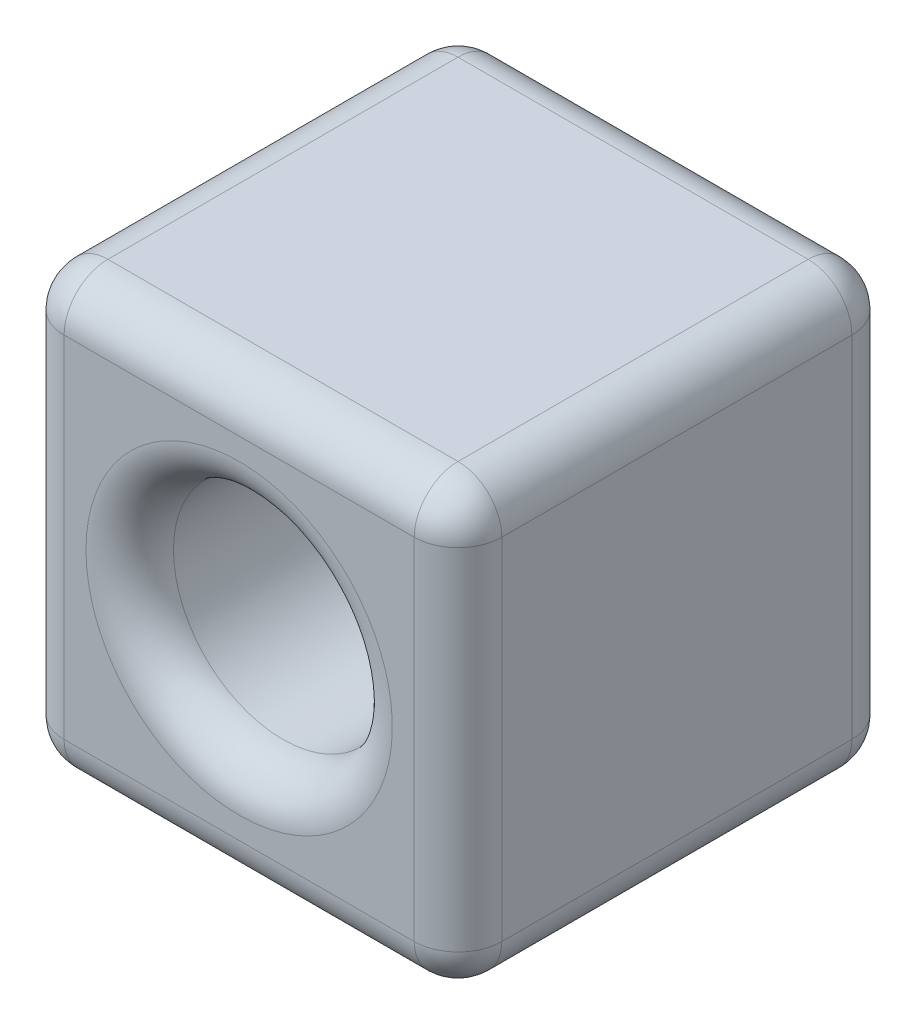
ISO-10303-21;
HEADER;
FILE_DESCRIPTION(('STEP AP214'),'2;1');
FILE_NAME('part.step','',(''),(''),'','','');
FILE_SCHEMA(('AUTOMOTIVE_DESIGN { 1 0 10303 214 1 1 1 1 }'));
ENDSEC;
DATA;
#1=APPLICATION_CONTEXT('core data for automotive mechanical design processes');
#2=APPLICATION_PROTOCOL_DEFINITION('international standard','automotive_design',2000,#1);
#3=PRODUCT_CONTEXT('',#1,'mechanical');
#4=PRODUCT('Part','Part','',(#3));
#5=PRODUCT_RELATED_PRODUCT_CATEGORY('part','',(#4));
#6=PRODUCT_DEFINITION_FORMATION('','',#4);
#7=PRODUCT_DEFINITION_CONTEXT('part definition',#1,'design');
#8=PRODUCT_DEFINITION('design','',#6,#7);
#9=PRODUCT_DEFINITION_SHAPE('','',#8);
#10=(LENGTH_UNIT() NAMED_UNIT(*) SI_UNIT(.MILLI.,.METRE.));
#11=(NAMED_UNIT(*) PLANE_ANGLE_UNIT() SI_UNIT($,.RADIAN.));
#12=(NAMED_UNIT(*) SI_UNIT($,.STERADIAN.) SOLID_ANGLE_UNIT());
#13=UNCERTAINTY_MEASURE_WITH_UNIT(LENGTH_MEASURE(1.E-05),#10,'distance_accuracy_value','');
#14=(GEOMETRIC_REPRESENTATION_CONTEXT(3) GLOBAL_UNCERTAINTY_ASSIGNED_CONTEXT((#13)) GLOBAL_UNIT_ASSIGNED_CONTEXT((#10,
#11,#12)) REPRESENTATION_CONTEXT('',''));
#15=CARTESIAN_POINT('',(0.,0.,0.));
#16=DIRECTION('',(0.,0.,1.));
#17=DIRECTION('',(1.,0.,0.));
#18=AXIS2_PLACEMENT_3D('',#15,#16,#17);
#19=CARTESIAN_POINT('',(0.,100.,0.));
#20=DIRECTION('',(1.,0.,0.));
#21=DIRECTION('',(0.,0.,-1.));
#22=AXIS2_PLACEMENT_3D('',#19,#20,#21);
#23=PLANE('',#22);
#24=DIRECTION('',(0.,-1.,0.));
#25=VECTOR('',#24,1.);
#26=CARTESIAN_POINT('',(0.,100.,-90.));
#27=LINE('',#26,#25);
#28=CARTESIAN_POINT('',(0.,90.,-90.));
#29=VERTEX_POINT('',#28);
#30=CARTESIAN_POINT('',(0.,9.99999999999999,-90.));
#31=VERTEX_POINT('',#30);
#32=EDGE_CURVE('E228',#29,#31,#27,.T.);
#33=ORIENTED_EDGE('',*,*,#32,.T.);
#34=DIRECTION('',(0.,0.,1.));
#35=VECTOR('',#34,1.);
#36=CARTESIAN_POINT('',(0.,9.99999999999999,-10.));
#37=LINE('',#36,#35);
#38=CARTESIAN_POINT('',(0.,9.99999999999999,-10.));
#39=VERTEX_POINT('',#38);
#40=EDGE_CURVE('E176',#31,#39,#37,.T.);
#41=ORIENTED_EDGE('',*,*,#40,.T.);
#42=DIRECTION('',(0.,-1.,0.));
#43=VECTOR('',#42,1.);
#44=CARTESIAN_POINT('',(0.,100.,-10.));
#45=LINE('',#44,#43);
#46=CARTESIAN_POINT('',(0.,90.,-10.));
#47=VERTEX_POINT('',#46);
#48=EDGE_CURVE('E134',#39,#47,#45,.F.);
#49=ORIENTED_EDGE('',*,*,#48,.T.);
#50=DIRECTION('',(0.,0.,1.));
#51=VECTOR('',#50,1.);
#52=CARTESIAN_POINT('',(0.,90.,0.));
#53=LINE('',#52,#51);
#54=EDGE_CURVE('E174',#47,#29,#53,.F.);
#55=ORIENTED_EDGE('',*,*,#54,.T.);
#56=EDGE_LOOP('',(#33,#41,#49,#55));
#57=FACE_BOUND('',#56,.T.);
#58=ADVANCED_FACE('F35',(#57),#23,.F.);
#59=CARTESIAN_POINT('',(0.,100.,0.));
#60=DIRECTION('',(0.,0.,-1.));
#61=DIRECTION('',(-1.,0.,0.));
#62=AXIS2_PLACEMENT_3D('',#59,#60,#61);
#63=PLANE('',#62);
#64=DIRECTION('',(1.,0.,0.));
#65=VECTOR('',#64,1.);
#66=CARTESIAN_POINT('',(0.,90.,0.));
#67=LINE('',#66,#65);
#68=CARTESIAN_POINT('',(90.,90.,0.));
#69=VERTEX_POINT('',#68);
#70=CARTESIAN_POINT('',(10.,90.,0.));
#71=VERTEX_POINT('',#70);
#72=EDGE_CURVE('E161',#69,#71,#67,.F.);
#73=ORIENTED_EDGE('',*,*,#72,.T.);
#74=DIRECTION('',(0.,-1.,0.));
#75=VECTOR('',#74,1.);
#76=CARTESIAN_POINT('',(10.,100.,0.));
#77=LINE('',#76,#75);
#78=CARTESIAN_POINT('',(10.,9.99999999999999,0.));
#79=VERTEX_POINT('',#78);
#80=EDGE_CURVE('E131',#71,#79,#77,.T.);
#81=ORIENTED_EDGE('',*,*,#80,.T.);
#82=DIRECTION('',(1.,0.,0.));
#83=VECTOR('',#82,1.);
#84=CARTESIAN_POINT('',(100.,9.99999999999999,0.));
#85=LINE('',#84,#83);
#86=CARTESIAN_POINT('',(90.,9.99999999999999,0.));
#87=VERTEX_POINT('',#86);
#88=EDGE_CURVE('E145',#79,#87,#85,.T.);
#89=ORIENTED_EDGE('',*,*,#88,.T.);
#90=DIRECTION('',(0.,-1.,0.));
#91=VECTOR('',#90,1.);
#92=CARTESIAN_POINT('',(90.,100.,0.));
#93=LINE('',#92,#91);
#94=EDGE_CURVE('E154',#87,#69,#93,.F.);
#95=ORIENTED_EDGE('',*,*,#94,.T.);
#96=EDGE_LOOP('',(#73,#81,#89,#95));
#97=FACE_BOUND('',#96,.T.);
#98=CARTESIAN_POINT('',(50.,50.,0.));
#99=DIRECTION('',(0.,0.,-1.));
#100=DIRECTION('',(-1.,0.,0.));
#101=AXIS2_PLACEMENT_3D('',#98,#99,#100);
#102=CIRCLE('',#101,35.);
#103=CARTESIAN_POINT('',(15.,50.,0.));
#104=VERTEX_POINT('',#103);
#105=EDGE_CURVE('E155',#104,#104,#102,.T.);
#106=ORIENTED_EDGE('',*,*,#105,.T.);
#107=EDGE_LOOP('',(#106));
#108=FACE_BOUND('',#107,.T.);
#109=ADVANCED_FACE('F158',(#97,#108),#63,.F.);
#110=CARTESIAN_POINT('',(100.,100.,0.));
#111=DIRECTION('',(-1.,0.,0.));
#112=DIRECTION('',(0.,0.,1.));
#113=AXIS2_PLACEMENT_3D('',#110,#111,#112);
#114=PLANE('',#113);
#115=DIRECTION('',(0.,-1.,0.));
#116=VECTOR('',#115,1.);
#117=CARTESIAN_POINT('',(100.,100.,-90.));
#118=LINE('',#117,#116);
#119=CARTESIAN_POINT('',(100.,9.99999999999999,-90.));
#120=VERTEX_POINT('',#119);
#121=CARTESIAN_POINT('',(100.,90.,-90.));
#122=VERTEX_POINT('',#121);
#123=EDGE_CURVE('E223',#120,#122,#118,.F.);
#124=ORIENTED_EDGE('',*,*,#123,.T.);
#125=DIRECTION('',(0.,0.,-1.));
#126=VECTOR('',#125,1.);
#127=CARTESIAN_POINT('',(100.,90.,0.));
#128=LINE('',#127,#126);
#129=CARTESIAN_POINT('',(100.,90.,-10.));
#130=VERTEX_POINT('',#129);
#131=EDGE_CURVE('E255',#122,#130,#128,.F.);
#132=ORIENTED_EDGE('',*,*,#131,.T.);
#133=DIRECTION('',(0.,-1.,0.));
#134=VECTOR('',#133,1.);
#135=CARTESIAN_POINT('',(100.,100.,-10.));
#136=LINE('',#135,#134);
#137=CARTESIAN_POINT('',(100.,9.99999999999999,-10.));
#138=VERTEX_POINT('',#137);
#139=EDGE_CURVE('E197',#130,#138,#136,.T.);
#140=ORIENTED_EDGE('',*,*,#139,.T.);
#141=DIRECTION('',(0.,0.,-1.));
#142=VECTOR('',#141,1.);
#143=CARTESIAN_POINT('',(100.,9.99999999999999,-90.));
#144=LINE('',#143,#142);
#145=EDGE_CURVE('E253',#138,#120,#144,.T.);
#146=ORIENTED_EDGE('',*,*,#145,.T.);
#147=EDGE_LOOP('',(#124,#132,#140,#146));
#148=FACE_BOUND('',#147,.T.);
#149=ADVANCED_FACE('F343',(#148),#114,.F.);
#150=CARTESIAN_POINT('',(0.,100.,-100.));
#151=DIRECTION('',(0.,0.,1.));
#152=DIRECTION('',(1.,0.,0.));
#153=AXIS2_PLACEMENT_3D('',#150,#151,#152);
#154=PLANE('',#153);
#155=DIRECTION('',(-1.,0.,0.));
#156=VECTOR('',#155,1.);
#157=CARTESIAN_POINT('',(0.,90.,-100.));
#158=LINE('',#157,#156);
#159=CARTESIAN_POINT('',(10.,90.,-100.));
#160=VERTEX_POINT('',#159);
#161=CARTESIAN_POINT('',(90.,90.,-100.));
#162=VERTEX_POINT('',#161);
#163=EDGE_CURVE('E217',#160,#162,#158,.F.);
#164=ORIENTED_EDGE('',*,*,#163,.T.);
#165=DIRECTION('',(0.,-1.,0.));
#166=VECTOR('',#165,1.);
#167=CARTESIAN_POINT('',(90.,100.,-100.));
#168=LINE('',#167,#166);
#169=CARTESIAN_POINT('',(90.,9.99999999999999,-100.));
#170=VERTEX_POINT('',#169);
#171=EDGE_CURVE('E220',#162,#170,#168,.T.);
#172=ORIENTED_EDGE('',*,*,#171,.T.);
#173=DIRECTION('',(-1.,0.,0.));
#174=VECTOR('',#173,1.);
#175=CARTESIAN_POINT('',(0.,9.99999999999999,-100.));
#176=LINE('',#175,#174);
#177=CARTESIAN_POINT('',(10.,9.99999999999999,-100.));
#178=VERTEX_POINT('',#177);
#179=EDGE_CURVE('E211',#170,#178,#176,.T.);
#180=ORIENTED_EDGE('',*,*,#179,.T.);
#181=DIRECTION('',(0.,-1.,0.));
#182=VECTOR('',#181,1.);
#183=CARTESIAN_POINT('',(10.,100.,-100.));
#184=LINE('',#183,#182);
#185=EDGE_CURVE('E214',#178,#160,#184,.F.);
#186=ORIENTED_EDGE('',*,*,#185,.T.);
#187=EDGE_LOOP('',(#164,#172,#180,#186));
#188=FACE_BOUND('',#187,.T.);
#189=CARTESIAN_POINT('',(50.,50.,-100.));
#190=DIRECTION('',(0.,0.,1.));
#191=DIRECTION('',(1.,0.,0.));
#192=AXIS2_PLACEMENT_3D('',#189,#190,#191);
#193=CIRCLE('',#192,35.);
#194=CARTESIAN_POINT('',(85.,50.,-100.));
#195=VERTEX_POINT('',#194);
#196=EDGE_CURVE('E208',#195,#195,#193,.T.);
#197=ORIENTED_EDGE('',*,*,#196,.T.);
#198=EDGE_LOOP('',(#197));
#199=FACE_BOUND('',#198,.T.);
#200=ADVANCED_FACE('F290',(#188,#199),#154,.F.);
#201=CARTESIAN_POINT('',(0.,100.,0.));
#202=DIRECTION('',(0.,-1.,0.));
#203=DIRECTION('',(0.,0.,-1.));
#204=AXIS2_PLACEMENT_3D('',#201,#202,#203);
#205=PLANE('',#204);
#206=DIRECTION('',(-1.,0.,0.));
#207=VECTOR('',#206,1.);
#208=CARTESIAN_POINT('',(0.,100.,-90.));
#209=LINE('',#208,#207);
#210=CARTESIAN_POINT('',(90.,100.,-90.));
#211=VERTEX_POINT('',#210);
#212=CARTESIAN_POINT('',(10.,100.,-90.));
#213=VERTEX_POINT('',#212);
#214=EDGE_CURVE('E226',#211,#213,#209,.T.);
#215=ORIENTED_EDGE('',*,*,#214,.T.);
#216=DIRECTION('',(0.,0.,1.));
#217=VECTOR('',#216,1.);
#218=CARTESIAN_POINT('',(10.,100.,0.));
#219=LINE('',#218,#217);
#220=CARTESIAN_POINT('',(10.,100.,-10.));
#221=VERTEX_POINT('',#220);
#222=EDGE_CURVE('E11',#213,#221,#219,.T.);
#223=ORIENTED_EDGE('',*,*,#222,.T.);
#224=DIRECTION('',(1.,0.,0.));
#225=VECTOR('',#224,1.);
#226=CARTESIAN_POINT('',(0.,100.,-10.));
#227=LINE('',#226,#225);
#228=CARTESIAN_POINT('',(90.,100.,-10.));
#229=VERTEX_POINT('',#228);
#230=EDGE_CURVE('E194',#221,#229,#227,.T.);
#231=ORIENTED_EDGE('',*,*,#230,.T.);
#232=DIRECTION('',(0.,0.,-1.));
#233=VECTOR('',#232,1.);
#234=CARTESIAN_POINT('',(90.,100.,0.));
#235=LINE('',#234,#233);
#236=EDGE_CURVE('E251',#229,#211,#235,.T.);
#237=ORIENTED_EDGE('',*,*,#236,.T.);
#238=EDGE_LOOP('',(#215,#223,#231,#237));
#239=FACE_BOUND('',#238,.T.);
#240=ADVANCED_FACE('F302',(#239),#205,.F.);
#241=CARTESIAN_POINT('',(0.,0.,0.));
#242=DIRECTION('',(0.,-1.,0.));
#243=DIRECTION('',(0.,0.,-1.));
#244=AXIS2_PLACEMENT_3D('',#241,#242,#243);
#245=PLANE('',#244);
#246=DIRECTION('',(1.,0.,0.));
#247=VECTOR('',#246,1.);
#248=CARTESIAN_POINT('',(0.,0.,-10.));
#249=LINE('',#248,#247);
#250=CARTESIAN_POINT('',(90.,0.,-10.));
#251=VERTEX_POINT('',#250);
#252=CARTESIAN_POINT('',(10.,0.,-10.));
#253=VERTEX_POINT('',#252);
#254=EDGE_CURVE('E200',#251,#253,#249,.F.);
#255=ORIENTED_EDGE('',*,*,#254,.T.);
#256=DIRECTION('',(0.,0.,1.));
#257=VECTOR('',#256,1.);
#258=CARTESIAN_POINT('',(10.,0.,-90.));
#259=LINE('',#258,#257);
#260=CARTESIAN_POINT('',(9.99999999999999,0.,-90.));
#261=VERTEX_POINT('',#260);
#262=EDGE_CURVE('E44',#253,#261,#259,.F.);
#263=ORIENTED_EDGE('',*,*,#262,.T.);
#264=DIRECTION('',(-1.,0.,0.));
#265=VECTOR('',#264,1.);
#266=CARTESIAN_POINT('',(100.,0.,-90.));
#267=LINE('',#266,#265);
#268=CARTESIAN_POINT('',(90.,0.,-90.));
#269=VERTEX_POINT('',#268);
#270=EDGE_CURVE('E231',#261,#269,#267,.F.);
#271=ORIENTED_EDGE('',*,*,#270,.T.);
#272=DIRECTION('',(0.,0.,-1.));
#273=VECTOR('',#272,1.);
#274=CARTESIAN_POINT('',(90.,0.,-10.));
#275=LINE('',#274,#273);
#276=EDGE_CURVE('E257',#269,#251,#275,.F.);
#277=ORIENTED_EDGE('',*,*,#276,.T.);
#278=EDGE_LOOP('',(#255,#263,#271,#277));
#279=FACE_BOUND('',#278,.T.);
#280=ADVANCED_FACE('F325',(#279),#245,.T.);
#281=CARTESIAN_POINT('',(50.,50.,-100.));
#282=DIRECTION('',(0.,0.,1.));
#283=DIRECTION('',(1.,0.,0.));
#284=AXIS2_PLACEMENT_3D('',#281,#282,#283);
#285=CYLINDRICAL_SURFACE('',#284,25.);
#286=CARTESIAN_POINT('',(50.,50.,-90.));
#287=DIRECTION('',(0.,0.,1.));
#288=DIRECTION('',(1.,0.,0.));
#289=AXIS2_PLACEMENT_3D('',#286,#287,#288);
#290=CIRCLE('',#289,25.);
#291=CARTESIAN_POINT('',(75.,50.,-90.));
#292=VERTEX_POINT('',#291);
#293=EDGE_CURVE('E233',#292,#292,#290,.F.);
#294=ORIENTED_EDGE('',*,*,#293,.T.);
#295=EDGE_LOOP('',(#294));
#296=FACE_BOUND('',#295,.T.);
#297=CARTESIAN_POINT('',(50.,50.,-9.99999999999999));
#298=DIRECTION('',(0.,0.,-1.));
#299=DIRECTION('',(-1.,0.,0.));
#300=AXIS2_PLACEMENT_3D('',#297,#298,#299);
#301=CIRCLE('',#300,25.);
#302=CARTESIAN_POINT('',(25.,50.,-9.99999999999999));
#303=VERTEX_POINT('',#302);
#304=EDGE_CURVE('E205',#303,#303,#301,.F.);
#305=ORIENTED_EDGE('',*,*,#304,.T.);
#306=EDGE_LOOP('',(#305));
#307=FACE_BOUND('',#306,.T.);
#308=ADVANCED_FACE('F327',(#296,#307),#285,.F.);
#309=CARTESIAN_POINT('',(90.,100.,-10.));
#310=DIRECTION('',(0.,-1.,0.));
#311=DIRECTION('',(0.,0.,-1.));
#312=AXIS2_PLACEMENT_3D('',#309,#310,#311);
#313=CYLINDRICAL_SURFACE('',#312,10.);
#314=ORIENTED_EDGE('',*,*,#139,.F.);
#315=CARTESIAN_POINT('',(90.,90.,-10.));
#316=DIRECTION('',(0.,-1.,0.));
#317=DIRECTION('',(0.,0.,-1.));
#318=AXIS2_PLACEMENT_3D('',#315,#316,#317);
#319=CIRCLE('',#318,10.);
#320=EDGE_CURVE('E239',#130,#69,#319,.T.);
#321=ORIENTED_EDGE('',*,*,#320,.T.);
#322=ORIENTED_EDGE('',*,*,#94,.F.);
#323=CARTESIAN_POINT('',(90.,9.99999999999999,-10.));
#324=DIRECTION('',(0.,-1.,0.));
#325=DIRECTION('',(0.,0.,-1.));
#326=AXIS2_PLACEMENT_3D('',#323,#324,#325);
#327=CIRCLE('',#326,10.);
#328=EDGE_CURVE('E237',#87,#138,#327,.F.);
#329=ORIENTED_EDGE('',*,*,#328,.T.);
#330=EDGE_LOOP('',(#314,#321,#322,#329));
#331=FACE_BOUND('',#330,.T.);
#332=ADVANCED_FACE('F333',(#331),#313,.T.);
#333=CARTESIAN_POINT('',(0.,90.,-10.));
#334=DIRECTION('',(1.,0.,0.));
#335=DIRECTION('',(0.,0.,-1.));
#336=AXIS2_PLACEMENT_3D('',#333,#334,#335);
#337=CYLINDRICAL_SURFACE('',#336,10.);
#338=ORIENTED_EDGE('',*,*,#230,.F.);
#339=CARTESIAN_POINT('',(10.,90.,-10.));
#340=DIRECTION('',(1.,0.,0.));
#341=DIRECTION('',(0.,0.,-1.));
#342=AXIS2_PLACEMENT_3D('',#339,#340,#341);
#343=CIRCLE('',#342,10.);
#344=EDGE_CURVE('E169',#221,#71,#343,.T.);
#345=ORIENTED_EDGE('',*,*,#344,.T.);
#346=ORIENTED_EDGE('',*,*,#72,.F.);
#347=CARTESIAN_POINT('',(90.,90.,-10.));
#348=DIRECTION('',(1.,0.,0.));
#349=DIRECTION('',(0.,0.,-1.));
#350=AXIS2_PLACEMENT_3D('',#347,#348,#349);
#351=CIRCLE('',#350,10.);
#352=EDGE_CURVE('E195',#69,#229,#351,.F.);
#353=ORIENTED_EDGE('',*,*,#352,.T.);
#354=EDGE_LOOP('',(#338,#345,#346,#353));
#355=FACE_BOUND('',#354,.T.);
#356=ADVANCED_FACE('F191',(#355),#337,.T.);
#357=CARTESIAN_POINT('',(0.,9.99999999999999,-10.));
#358=DIRECTION('',(-1.,0.,0.));
#359=DIRECTION('',(0.,0.,1.));
#360=AXIS2_PLACEMENT_3D('',#357,#358,#359);
#361=CYLINDRICAL_SURFACE('',#360,10.);
#362=ORIENTED_EDGE('',*,*,#88,.F.);
#363=CARTESIAN_POINT('',(10.,9.99999999999999,-10.));
#364=DIRECTION('',(-1.,0.,0.));
#365=DIRECTION('',(0.,0.,1.));
#366=AXIS2_PLACEMENT_3D('',#363,#364,#365);
#367=CIRCLE('',#366,10.);
#368=EDGE_CURVE('E139',#79,#253,#367,.F.);
#369=ORIENTED_EDGE('',*,*,#368,.T.);
#370=ORIENTED_EDGE('',*,*,#254,.F.);
#371=CARTESIAN_POINT('',(90.,9.99999999999999,-10.));
#372=DIRECTION('',(-1.,0.,0.));
#373=DIRECTION('',(0.,0.,1.));
#374=AXIS2_PLACEMENT_3D('',#371,#372,#373);
#375=CIRCLE('',#374,10.);
#376=EDGE_CURVE('E150',#251,#87,#375,.T.);
#377=ORIENTED_EDGE('',*,*,#376,.T.);
#378=EDGE_LOOP('',(#362,#369,#370,#377));
#379=FACE_BOUND('',#378,.T.);
#380=ADVANCED_FACE('F146',(#379),#361,.T.);
#381=CARTESIAN_POINT('',(10.,100.,-10.));
#382=DIRECTION('',(0.,-1.,0.));
#383=DIRECTION('',(0.,0.,-1.));
#384=AXIS2_PLACEMENT_3D('',#381,#382,#383);
#385=CYLINDRICAL_SURFACE('',#384,10.);
#386=ORIENTED_EDGE('',*,*,#48,.F.);
#387=CARTESIAN_POINT('',(10.,9.99999999999999,-10.));
#388=DIRECTION('',(0.,-1.,0.));
#389=DIRECTION('',(0.,0.,-1.));
#390=AXIS2_PLACEMENT_3D('',#387,#388,#389);
#391=CIRCLE('',#390,10.);
#392=EDGE_CURVE('E127',#39,#79,#391,.F.);
#393=ORIENTED_EDGE('',*,*,#392,.T.);
#394=ORIENTED_EDGE('',*,*,#80,.F.);
#395=CARTESIAN_POINT('',(10.,90.,-10.));
#396=DIRECTION('',(0.,-1.,0.));
#397=DIRECTION('',(0.,0.,-1.));
#398=AXIS2_PLACEMENT_3D('',#395,#396,#397);
#399=CIRCLE('',#398,10.);
#400=EDGE_CURVE('E140',#71,#47,#399,.T.);
#401=ORIENTED_EDGE('',*,*,#400,.T.);
#402=EDGE_LOOP('',(#386,#393,#394,#401));
#403=FACE_BOUND('',#402,.T.);
#404=ADVANCED_FACE('F129',(#403),#385,.T.);
#405=CARTESIAN_POINT('',(50.,50.,-9.99999999999999));
#406=DIRECTION('',(0.,0.,-1.));
#407=DIRECTION('',(-1.,0.,0.));
#408=AXIS2_PLACEMENT_3D('',#405,#406,#407);
#409=TOROIDAL_SURFACE('',#408,35.,10.);
#410=ORIENTED_EDGE('',*,*,#105,.F.);
#411=EDGE_LOOP('',(#410));
#412=FACE_BOUND('',#411,.T.);
#413=ORIENTED_EDGE('',*,*,#304,.F.);
#414=EDGE_LOOP('',(#413));
#415=FACE_BOUND('',#414,.T.);
#416=ADVANCED_FACE('F349',(#412,#415),#409,.T.);
#417=CARTESIAN_POINT('',(10.,100.,-90.));
#418=DIRECTION('',(0.,-1.,0.));
#419=DIRECTION('',(0.,0.,-1.));
#420=AXIS2_PLACEMENT_3D('',#417,#418,#419);
#421=CYLINDRICAL_SURFACE('',#420,10.);
#422=ORIENTED_EDGE('',*,*,#185,.F.);
#423=CARTESIAN_POINT('',(10.,9.99999999999999,-90.));
#424=DIRECTION('',(0.,-1.,0.));
#425=DIRECTION('',(0.,0.,-1.));
#426=AXIS2_PLACEMENT_3D('',#423,#424,#425);
#427=CIRCLE('',#426,10.);
#428=EDGE_CURVE('E274',#178,#31,#427,.F.);
#429=ORIENTED_EDGE('',*,*,#428,.T.);
#430=ORIENTED_EDGE('',*,*,#32,.F.);
#431=CARTESIAN_POINT('',(10.,90.,-90.));
#432=DIRECTION('',(0.,-1.,0.));
#433=DIRECTION('',(0.,0.,-1.));
#434=AXIS2_PLACEMENT_3D('',#431,#432,#433);
#435=CIRCLE('',#434,10.);
#436=EDGE_CURVE('E272',#29,#160,#435,.T.);
#437=ORIENTED_EDGE('',*,*,#436,.T.);
#438=EDGE_LOOP('',(#422,#429,#430,#437));
#439=FACE_BOUND('',#438,.T.);
#440=ADVANCED_FACE('F296',(#439),#421,.T.);
#441=CARTESIAN_POINT('',(0.,90.,-90.));
#442=DIRECTION('',(-1.,0.,0.));
#443=DIRECTION('',(0.,0.,1.));
#444=AXIS2_PLACEMENT_3D('',#441,#442,#443);
#445=CYLINDRICAL_SURFACE('',#444,10.);
#446=ORIENTED_EDGE('',*,*,#163,.F.);
#447=CARTESIAN_POINT('',(10.,90.,-90.));
#448=DIRECTION('',(-1.,0.,0.));
#449=DIRECTION('',(0.,0.,1.));
#450=AXIS2_PLACEMENT_3D('',#447,#448,#449);
#451=CIRCLE('',#450,10.);
#452=EDGE_CURVE('E166',#160,#213,#451,.F.);
#453=ORIENTED_EDGE('',*,*,#452,.T.);
#454=ORIENTED_EDGE('',*,*,#214,.F.);
#455=CARTESIAN_POINT('',(90.,90.,-90.));
#456=DIRECTION('',(-1.,0.,0.));
#457=DIRECTION('',(0.,0.,1.));
#458=AXIS2_PLACEMENT_3D('',#455,#456,#457);
#459=CIRCLE('',#458,10.);
#460=EDGE_CURVE('E245',#211,#162,#459,.T.);
#461=ORIENTED_EDGE('',*,*,#460,.T.);
#462=EDGE_LOOP('',(#446,#453,#454,#461));
#463=FACE_BOUND('',#462,.T.);
#464=ADVANCED_FACE('F300',(#463),#445,.T.);
#465=CARTESIAN_POINT('',(0.,9.99999999999999,-90.));
#466=DIRECTION('',(1.,0.,0.));
#467=DIRECTION('',(0.,0.,-1.));
#468=AXIS2_PLACEMENT_3D('',#465,#466,#467);
#469=CYLINDRICAL_SURFACE('',#468,10.);
#470=ORIENTED_EDGE('',*,*,#270,.F.);
#471=CARTESIAN_POINT('',(10.,9.99999999999999,-90.));
#472=DIRECTION('',(1.,0.,0.));
#473=DIRECTION('',(0.,0.,-1.));
#474=AXIS2_PLACEMENT_3D('',#471,#472,#473);
#475=CIRCLE('',#474,10.);
#476=EDGE_CURVE('E259',#261,#178,#475,.T.);
#477=ORIENTED_EDGE('',*,*,#476,.T.);
#478=ORIENTED_EDGE('',*,*,#179,.F.);
#479=CARTESIAN_POINT('',(90.,9.99999999999999,-90.));
#480=DIRECTION('',(1.,0.,0.));
#481=DIRECTION('',(0.,0.,-1.));
#482=AXIS2_PLACEMENT_3D('',#479,#480,#481);
#483=CIRCLE('',#482,10.);
#484=EDGE_CURVE('E248',#170,#269,#483,.F.);
#485=ORIENTED_EDGE('',*,*,#484,.T.);
#486=EDGE_LOOP('',(#470,#477,#478,#485));
#487=FACE_BOUND('',#486,.T.);
#488=ADVANCED_FACE('F287',(#487),#469,.T.);
#489=CARTESIAN_POINT('',(90.,100.,-90.));
#490=DIRECTION('',(0.,-1.,0.));
#491=DIRECTION('',(0.,0.,-1.));
#492=AXIS2_PLACEMENT_3D('',#489,#490,#491);
#493=CYLINDRICAL_SURFACE('',#492,10.);
#494=ORIENTED_EDGE('',*,*,#171,.F.);
#495=CARTESIAN_POINT('',(90.,90.,-90.));
#496=DIRECTION('',(0.,-1.,0.));
#497=DIRECTION('',(0.,0.,-1.));
#498=AXIS2_PLACEMENT_3D('',#495,#496,#497);
#499=CIRCLE('',#498,10.);
#500=EDGE_CURVE('E243',#162,#122,#499,.T.);
#501=ORIENTED_EDGE('',*,*,#500,.T.);
#502=ORIENTED_EDGE('',*,*,#123,.F.);
#503=CARTESIAN_POINT('',(90.,9.99999999999999,-90.));
#504=DIRECTION('',(0.,-1.,0.));
#505=DIRECTION('',(0.,0.,-1.));
#506=AXIS2_PLACEMENT_3D('',#503,#504,#505);
#507=CIRCLE('',#506,10.);
#508=EDGE_CURVE('E241',#120,#170,#507,.F.);
#509=ORIENTED_EDGE('',*,*,#508,.T.);
#510=EDGE_LOOP('',(#494,#501,#502,#509));
#511=FACE_BOUND('',#510,.T.);
#512=ADVANCED_FACE('F313',(#511),#493,.T.);
#513=CARTESIAN_POINT('',(50.,50.,-90.));
#514=DIRECTION('',(0.,0.,1.));
#515=DIRECTION('',(1.,0.,0.));
#516=AXIS2_PLACEMENT_3D('',#513,#514,#515);
#517=TOROIDAL_SURFACE('',#516,35.,10.);
#518=ORIENTED_EDGE('',*,*,#293,.F.);
#519=EDGE_LOOP('',(#518));
#520=FACE_BOUND('',#519,.T.);
#521=ORIENTED_EDGE('',*,*,#196,.F.);
#522=EDGE_LOOP('',(#521));
#523=FACE_BOUND('',#522,.T.);
#524=ADVANCED_FACE('F362',(#520,#523),#517,.T.);
#525=CARTESIAN_POINT('',(90.,90.,-90.));
#526=DIRECTION('',(0.,0.,1.));
#527=DIRECTION('',(1.,0.,0.));
#528=AXIS2_PLACEMENT_3D('',#525,#526,#527);
#529=SPHERICAL_SURFACE('',#528,10.);
#530=ORIENTED_EDGE('',*,*,#500,.F.);
#531=ORIENTED_EDGE('',*,*,#460,.F.);
#532=CARTESIAN_POINT('',(90.,90.,-90.));
#533=DIRECTION('',(0.,0.,1.));
#534=DIRECTION('',(1.,0.,0.));
#535=AXIS2_PLACEMENT_3D('',#532,#533,#534);
#536=CIRCLE('',#535,10.);
#537=EDGE_CURVE('E262',#122,#211,#536,.T.);
#538=ORIENTED_EDGE('',*,*,#537,.F.);
#539=EDGE_LOOP('',(#530,#531,#538));
#540=FACE_BOUND('',#539,.T.);
#541=ADVANCED_FACE('F311',(#540),#529,.T.);
#542=CARTESIAN_POINT('',(90.,90.,0.));
#543=DIRECTION('',(0.,0.,-1.));
#544=DIRECTION('',(-1.,0.,0.));
#545=AXIS2_PLACEMENT_3D('',#542,#543,#544);
#546=CYLINDRICAL_SURFACE('',#545,10.);
#547=ORIENTED_EDGE('',*,*,#537,.T.);
#548=ORIENTED_EDGE('',*,*,#236,.F.);
#549=CARTESIAN_POINT('',(90.,90.,-10.));
#550=DIRECTION('',(0.,0.,1.));
#551=DIRECTION('',(1.,0.,0.));
#552=AXIS2_PLACEMENT_3D('',#549,#550,#551);
#553=CIRCLE('',#552,10.);
#554=EDGE_CURVE('E260',#130,#229,#553,.T.);
#555=ORIENTED_EDGE('',*,*,#554,.F.);
#556=ORIENTED_EDGE('',*,*,#131,.F.);
#557=EDGE_LOOP('',(#547,#548,#555,#556));
#558=FACE_BOUND('',#557,.T.);
#559=ADVANCED_FACE('F306',(#558),#546,.T.);
#560=CARTESIAN_POINT('',(90.,90.,-10.));
#561=DIRECTION('',(0.,0.,1.));
#562=DIRECTION('',(1.,0.,0.));
#563=AXIS2_PLACEMENT_3D('',#560,#561,#562);
#564=SPHERICAL_SURFACE('',#563,10.);
#565=ORIENTED_EDGE('',*,*,#352,.F.);
#566=ORIENTED_EDGE('',*,*,#320,.F.);
#567=ORIENTED_EDGE('',*,*,#554,.T.);
#568=EDGE_LOOP('',(#565,#566,#567));
#569=FACE_BOUND('',#568,.T.);
#570=ADVANCED_FACE('F372',(#569),#564,.T.);
#571=CARTESIAN_POINT('',(90.,9.99999999999999,-90.));
#572=DIRECTION('',(0.,0.,1.));
#573=DIRECTION('',(1.,0.,0.));
#574=AXIS2_PLACEMENT_3D('',#571,#572,#573);
#575=SPHERICAL_SURFACE('',#574,10.);
#576=ORIENTED_EDGE('',*,*,#484,.F.);
#577=ORIENTED_EDGE('',*,*,#508,.F.);
#578=CARTESIAN_POINT('',(90.,9.99999999999999,-90.));
#579=DIRECTION('',(0.,0.,1.));
#580=DIRECTION('',(1.,0.,0.));
#581=AXIS2_PLACEMENT_3D('',#578,#579,#580);
#582=CIRCLE('',#581,10.);
#583=EDGE_CURVE('E263',#269,#120,#582,.T.);
#584=ORIENTED_EDGE('',*,*,#583,.F.);
#585=EDGE_LOOP('',(#576,#577,#584));
#586=FACE_BOUND('',#585,.T.);
#587=ADVANCED_FACE('F318',(#586),#575,.T.);
#588=CARTESIAN_POINT('',(90.,9.99999999999999,0.));
#589=DIRECTION('',(0.,0.,1.));
#590=DIRECTION('',(1.,0.,0.));
#591=AXIS2_PLACEMENT_3D('',#588,#589,#590);
#592=CYLINDRICAL_SURFACE('',#591,10.);
#593=ORIENTED_EDGE('',*,*,#583,.T.);
#594=ORIENTED_EDGE('',*,*,#145,.F.);
#595=CARTESIAN_POINT('',(90.,10.,-10.));
#596=DIRECTION('',(0.,0.,1.));
#597=DIRECTION('',(1.,0.,0.));
#598=AXIS2_PLACEMENT_3D('',#595,#596,#597);
#599=CIRCLE('',#598,10.);
#600=EDGE_CURVE('E182',#251,#138,#599,.T.);
#601=ORIENTED_EDGE('',*,*,#600,.F.);
#602=ORIENTED_EDGE('',*,*,#276,.F.);
#603=EDGE_LOOP('',(#593,#594,#601,#602));
#604=FACE_BOUND('',#603,.T.);
#605=ADVANCED_FACE('F322',(#604),#592,.T.);
#606=CARTESIAN_POINT('',(90.,9.99999999999999,-10.));
#607=DIRECTION('',(0.,0.,1.));
#608=DIRECTION('',(1.,0.,0.));
#609=AXIS2_PLACEMENT_3D('',#606,#607,#608);
#610=SPHERICAL_SURFACE('',#609,10.);
#611=ORIENTED_EDGE('',*,*,#600,.T.);
#612=ORIENTED_EDGE('',*,*,#328,.F.);
#613=ORIENTED_EDGE('',*,*,#376,.F.);
#614=EDGE_LOOP('',(#611,#612,#613));
#615=FACE_BOUND('',#614,.T.);
#616=ADVANCED_FACE('F380',(#615),#610,.T.);
#617=CARTESIAN_POINT('',(10.,9.99999999999999,-10.));
#618=DIRECTION('',(0.,0.,1.));
#619=DIRECTION('',(1.,0.,0.));
#620=AXIS2_PLACEMENT_3D('',#617,#618,#619);
#621=SPHERICAL_SURFACE('',#620,10.);
#622=ORIENTED_EDGE('',*,*,#368,.F.);
#623=ORIENTED_EDGE('',*,*,#392,.F.);
#624=CARTESIAN_POINT('',(10.,9.99999999999999,-10.));
#625=DIRECTION('',(0.,0.,-1.));
#626=DIRECTION('',(-1.,0.,0.));
#627=AXIS2_PLACEMENT_3D('',#624,#625,#626);
#628=CIRCLE('',#627,10.);
#629=EDGE_CURVE('E164',#253,#39,#628,.T.);
#630=ORIENTED_EDGE('',*,*,#629,.F.);
#631=EDGE_LOOP('',(#622,#623,#630));
#632=FACE_BOUND('',#631,.T.);
#633=ADVANCED_FACE('F163',(#632),#621,.T.);
#634=CARTESIAN_POINT('',(10.,9.99999999999999,0.));
#635=DIRECTION('',(0.,0.,-1.));
#636=DIRECTION('',(-1.,0.,0.));
#637=AXIS2_PLACEMENT_3D('',#634,#635,#636);
#638=CYLINDRICAL_SURFACE('',#637,10.);
#639=ORIENTED_EDGE('',*,*,#629,.T.);
#640=ORIENTED_EDGE('',*,*,#40,.F.);
#641=CARTESIAN_POINT('',(10.,10.,-90.));
#642=DIRECTION('',(0.,0.,-1.));
#643=DIRECTION('',(-1.,0.,0.));
#644=AXIS2_PLACEMENT_3D('',#641,#642,#643);
#645=CIRCLE('',#644,10.);
#646=EDGE_CURVE('E179',#261,#31,#645,.T.);
#647=ORIENTED_EDGE('',*,*,#646,.F.);
#648=ORIENTED_EDGE('',*,*,#262,.F.);
#649=EDGE_LOOP('',(#639,#640,#647,#648));
#650=FACE_BOUND('',#649,.T.);
#651=ADVANCED_FACE('F280',(#650),#638,.T.);
#652=CARTESIAN_POINT('',(10.,9.99999999999999,-90.));
#653=DIRECTION('',(0.,0.,1.));
#654=DIRECTION('',(1.,0.,0.));
#655=AXIS2_PLACEMENT_3D('',#652,#653,#654);
#656=SPHERICAL_SURFACE('',#655,10.);
#657=ORIENTED_EDGE('',*,*,#646,.T.);
#658=ORIENTED_EDGE('',*,*,#428,.F.);
#659=ORIENTED_EDGE('',*,*,#476,.F.);
#660=EDGE_LOOP('',(#657,#658,#659));
#661=FACE_BOUND('',#660,.T.);
#662=ADVANCED_FACE('F283',(#661),#656,.T.);
#663=CARTESIAN_POINT('',(10.,90.,-10.));
#664=DIRECTION('',(0.,0.,1.));
#665=DIRECTION('',(1.,0.,0.));
#666=AXIS2_PLACEMENT_3D('',#663,#664,#665);
#667=SPHERICAL_SURFACE('',#666,10.);
#668=ORIENTED_EDGE('',*,*,#400,.F.);
#669=ORIENTED_EDGE('',*,*,#344,.F.);
#670=CARTESIAN_POINT('',(10.,90.,-10.));
#671=DIRECTION('',(0.,0.,-1.));
#672=DIRECTION('',(-1.,0.,0.));
#673=AXIS2_PLACEMENT_3D('',#670,#671,#672);
#674=CIRCLE('',#673,10.);
#675=EDGE_CURVE('E39',#47,#221,#674,.T.);
#676=ORIENTED_EDGE('',*,*,#675,.F.);
#677=EDGE_LOOP('',(#668,#669,#676));
#678=FACE_BOUND('',#677,.T.);
#679=ADVANCED_FACE('F37',(#678),#667,.T.);
#680=CARTESIAN_POINT('',(10.,90.,0.));
#681=DIRECTION('',(0.,0.,1.));
#682=DIRECTION('',(1.,0.,0.));
#683=AXIS2_PLACEMENT_3D('',#680,#681,#682);
#684=CYLINDRICAL_SURFACE('',#683,10.);
#685=ORIENTED_EDGE('',*,*,#675,.T.);
#686=ORIENTED_EDGE('',*,*,#222,.F.);
#687=CARTESIAN_POINT('',(10.,90.,-90.));
#688=DIRECTION('',(0.,0.,-1.));
#689=DIRECTION('',(-1.,0.,0.));
#690=AXIS2_PLACEMENT_3D('',#687,#688,#689);
#691=CIRCLE('',#690,10.);
#692=EDGE_CURVE('E58',#29,#213,#691,.T.);
#693=ORIENTED_EDGE('',*,*,#692,.F.);
#694=ORIENTED_EDGE('',*,*,#54,.F.);
#695=EDGE_LOOP('',(#685,#686,#693,#694));
#696=FACE_BOUND('',#695,.T.);
#697=ADVANCED_FACE('F187',(#696),#684,.T.);
#698=CARTESIAN_POINT('',(10.,90.,-90.));
#699=DIRECTION('',(0.,0.,1.));
#700=DIRECTION('',(1.,0.,0.));
#701=AXIS2_PLACEMENT_3D('',#698,#699,#700);
#702=SPHERICAL_SURFACE('',#701,10.);
#703=ORIENTED_EDGE('',*,*,#452,.F.);
#704=ORIENTED_EDGE('',*,*,#436,.F.);
#705=ORIENTED_EDGE('',*,*,#692,.T.);
#706=EDGE_LOOP('',(#703,#704,#705));
#707=FACE_BOUND('',#706,.T.);
#708=ADVANCED_FACE('F297',(#707),#702,.T.);
#709=CLOSED_SHELL('',(#58,#109,#149,#200,#240,#280,#308,#332,#356,#380,#404,#416,#440,#464,#488,
#512,#524,#541,#559,#570,#587,#605,#616,#633,#651,#662,#679,#697,#708));
#710=MANIFOLD_SOLID_BREP('B2',#709);
#711=ADVANCED_BREP_SHAPE_REPRESENTATION('',(#18,#710),#14);
#712=SHAPE_DEFINITION_REPRESENTATION(#9,#711);
ENDSEC;
END-ISO-10303-21;
